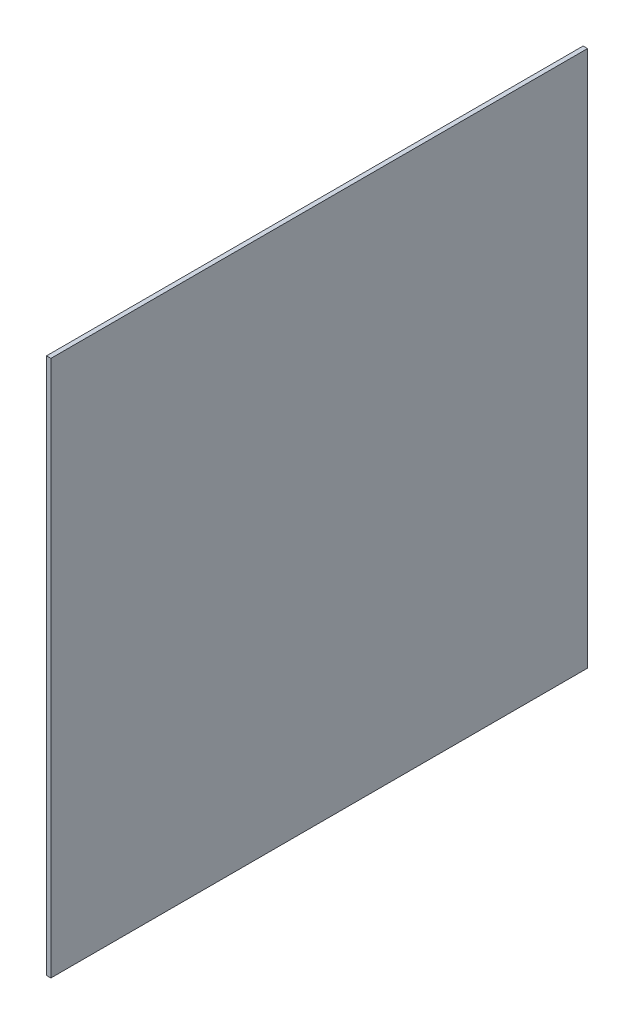
ISO-10303-21;
HEADER;
FILE_DESCRIPTION(('STEP AP214'),'2;1');
FILE_NAME('part.step','',(''),(''),'','','');
FILE_SCHEMA(('AUTOMOTIVE_DESIGN { 1 0 10303 214 1 1 1 1 }'));
ENDSEC;
DATA;
#1=APPLICATION_CONTEXT('core data for automotive mechanical design processes');
#2=APPLICATION_PROTOCOL_DEFINITION('international standard','automotive_design',2000,#1);
#3=PRODUCT_CONTEXT('',#1,'mechanical');
#4=PRODUCT('Part','Part','',(#3));
#5=PRODUCT_RELATED_PRODUCT_CATEGORY('part','',(#4));
#6=PRODUCT_DEFINITION_FORMATION('','',#4);
#7=PRODUCT_DEFINITION_CONTEXT('part definition',#1,'design');
#8=PRODUCT_DEFINITION('design','',#6,#7);
#9=PRODUCT_DEFINITION_SHAPE('','',#8);
#10=(LENGTH_UNIT() NAMED_UNIT(*) SI_UNIT(.MILLI.,.METRE.));
#11=(NAMED_UNIT(*) PLANE_ANGLE_UNIT() SI_UNIT($,.RADIAN.));
#12=(NAMED_UNIT(*) SI_UNIT($,.STERADIAN.) SOLID_ANGLE_UNIT());
#13=UNCERTAINTY_MEASURE_WITH_UNIT(LENGTH_MEASURE(1.E-05),#10,'distance_accuracy_value','');
#14=(GEOMETRIC_REPRESENTATION_CONTEXT(3) GLOBAL_UNCERTAINTY_ASSIGNED_CONTEXT((#13)) GLOBAL_UNIT_ASSIGNED_CONTEXT((#10,
#11,#12)) REPRESENTATION_CONTEXT('',''));
#15=CARTESIAN_POINT('',(0.,0.,0.));
#16=DIRECTION('',(0.,0.,1.));
#17=DIRECTION('',(1.,0.,0.));
#18=AXIS2_PLACEMENT_3D('',#15,#16,#17);
#19=CARTESIAN_POINT('',(4.7625,-289.71875,-289.71875));
#20=DIRECTION('',(0.,0.,1.));
#21=DIRECTION('',(1.,0.,0.));
#22=AXIS2_PLACEMENT_3D('',#19,#20,#21);
#23=PLANE('',#22);
#24=DIRECTION('',(0.,1.,0.));
#25=VECTOR('',#24,1.);
#26=CARTESIAN_POINT('',(0.,-289.71875,-289.71875));
#27=LINE('',#26,#25);
#28=CARTESIAN_POINT('',(0.,-289.71875,-289.71875));
#29=VERTEX_POINT('',#28);
#30=CARTESIAN_POINT('',(0.,289.71875,-289.71875));
#31=VERTEX_POINT('',#30);
#32=EDGE_CURVE('E96',#29,#31,#27,.T.);
#33=ORIENTED_EDGE('',*,*,#32,.T.);
#34=DIRECTION('',(-1.,0.,0.));
#35=VECTOR('',#34,1.);
#36=CARTESIAN_POINT('',(4.7625,289.71875,-289.71875));
#37=LINE('',#36,#35);
#38=CARTESIAN_POINT('',(4.7625,289.71875,-289.71875));
#39=VERTEX_POINT('',#38);
#40=EDGE_CURVE('E11',#39,#31,#37,.T.);
#41=ORIENTED_EDGE('',*,*,#40,.F.);
#42=DIRECTION('',(0.,1.,0.));
#43=VECTOR('',#42,1.);
#44=CARTESIAN_POINT('',(4.7625,-289.71875,-289.71875));
#45=LINE('',#44,#43);
#46=CARTESIAN_POINT('',(4.7625,-289.71875,-289.71875));
#47=VERTEX_POINT('',#46);
#48=EDGE_CURVE('E84',#47,#39,#45,.T.);
#49=ORIENTED_EDGE('',*,*,#48,.F.);
#50=DIRECTION('',(-1.,0.,0.));
#51=VECTOR('',#50,1.);
#52=CARTESIAN_POINT('',(4.7625,-289.71875,-289.71875));
#53=LINE('',#52,#51);
#54=EDGE_CURVE('E92',#47,#29,#53,.T.);
#55=ORIENTED_EDGE('',*,*,#54,.T.);
#56=EDGE_LOOP('',(#33,#41,#49,#55));
#57=FACE_BOUND('',#56,.T.);
#58=ADVANCED_FACE('F33',(#57),#23,.F.);
#59=CARTESIAN_POINT('',(4.7625,289.71875,289.71875));
#60=DIRECTION('',(0.,-1.,0.));
#61=DIRECTION('',(0.,0.,-1.));
#62=AXIS2_PLACEMENT_3D('',#59,#60,#61);
#63=PLANE('',#62);
#64=DIRECTION('',(0.,0.,1.));
#65=VECTOR('',#64,1.);
#66=CARTESIAN_POINT('',(0.,289.71875,289.71875));
#67=LINE('',#66,#65);
#68=CARTESIAN_POINT('',(0.,289.71875,289.71875));
#69=VERTEX_POINT('',#68);
#70=EDGE_CURVE('E88',#31,#69,#67,.T.);
#71=ORIENTED_EDGE('',*,*,#70,.T.);
#72=DIRECTION('',(-1.,0.,0.));
#73=VECTOR('',#72,1.);
#74=CARTESIAN_POINT('',(4.7625,289.71875,289.71875));
#75=LINE('',#74,#73);
#76=CARTESIAN_POINT('',(4.7625,289.71875,289.71875));
#77=VERTEX_POINT('',#76);
#78=EDGE_CURVE('E41',#77,#69,#75,.T.);
#79=ORIENTED_EDGE('',*,*,#78,.F.);
#80=DIRECTION('',(0.,0.,1.));
#81=VECTOR('',#80,1.);
#82=CARTESIAN_POINT('',(4.7625,289.71875,289.71875));
#83=LINE('',#82,#81);
#84=EDGE_CURVE('E79',#39,#77,#83,.T.);
#85=ORIENTED_EDGE('',*,*,#84,.F.);
#86=ORIENTED_EDGE('',*,*,#40,.T.);
#87=EDGE_LOOP('',(#71,#79,#85,#86));
#88=FACE_BOUND('',#87,.T.);
#89=ADVANCED_FACE('F87',(#88),#63,.F.);
#90=CARTESIAN_POINT('',(4.7625,-289.71875,289.71875));
#91=DIRECTION('',(0.,0.,-1.));
#92=DIRECTION('',(-1.,0.,0.));
#93=AXIS2_PLACEMENT_3D('',#90,#91,#92);
#94=PLANE('',#93);
#95=DIRECTION('',(0.,-1.,0.));
#96=VECTOR('',#95,1.);
#97=CARTESIAN_POINT('',(0.,-289.71875,289.71875));
#98=LINE('',#97,#96);
#99=CARTESIAN_POINT('',(0.,-289.71875,289.71875));
#100=VERTEX_POINT('',#99);
#101=EDGE_CURVE('E66',#69,#100,#98,.T.);
#102=ORIENTED_EDGE('',*,*,#101,.T.);
#103=DIRECTION('',(-1.,0.,0.));
#104=VECTOR('',#103,1.);
#105=CARTESIAN_POINT('',(4.7625,-289.71875,289.71875));
#106=LINE('',#105,#104);
#107=CARTESIAN_POINT('',(4.7625,-289.71875,289.71875));
#108=VERTEX_POINT('',#107);
#109=EDGE_CURVE('E89',#108,#100,#106,.T.);
#110=ORIENTED_EDGE('',*,*,#109,.F.);
#111=DIRECTION('',(0.,-1.,0.));
#112=VECTOR('',#111,1.);
#113=CARTESIAN_POINT('',(4.7625,-289.71875,289.71875));
#114=LINE('',#113,#112);
#115=EDGE_CURVE('E82',#77,#108,#114,.T.);
#116=ORIENTED_EDGE('',*,*,#115,.F.);
#117=ORIENTED_EDGE('',*,*,#78,.T.);
#118=EDGE_LOOP('',(#102,#110,#116,#117));
#119=FACE_BOUND('',#118,.T.);
#120=ADVANCED_FACE('F90',(#119),#94,.F.);
#121=CARTESIAN_POINT('',(4.7625,-289.71875,289.71875));
#122=DIRECTION('',(0.,1.,0.));
#123=DIRECTION('',(0.,0.,1.));
#124=AXIS2_PLACEMENT_3D('',#121,#122,#123);
#125=PLANE('',#124);
#126=DIRECTION('',(0.,0.,-1.));
#127=VECTOR('',#126,1.);
#128=CARTESIAN_POINT('',(0.,-289.71875,289.71875));
#129=LINE('',#128,#127);
#130=EDGE_CURVE('E72',#100,#29,#129,.T.);
#131=ORIENTED_EDGE('',*,*,#130,.T.);
#132=ORIENTED_EDGE('',*,*,#54,.F.);
#133=DIRECTION('',(0.,0.,-1.));
#134=VECTOR('',#133,1.);
#135=CARTESIAN_POINT('',(4.7625,-289.71875,289.71875));
#136=LINE('',#135,#134);
#137=EDGE_CURVE('E49',#108,#47,#136,.T.);
#138=ORIENTED_EDGE('',*,*,#137,.F.);
#139=ORIENTED_EDGE('',*,*,#109,.T.);
#140=EDGE_LOOP('',(#131,#132,#138,#139));
#141=FACE_BOUND('',#140,.T.);
#142=ADVANCED_FACE('F103',(#141),#125,.F.);
#143=CARTESIAN_POINT('',(4.7625,0.,0.));
#144=DIRECTION('',(-1.,0.,0.));
#145=DIRECTION('',(0.,0.,1.));
#146=AXIS2_PLACEMENT_3D('',#143,#144,#145);
#147=PLANE('',#146);
#148=ORIENTED_EDGE('',*,*,#48,.T.);
#149=ORIENTED_EDGE('',*,*,#84,.T.);
#150=ORIENTED_EDGE('',*,*,#115,.T.);
#151=ORIENTED_EDGE('',*,*,#137,.T.);
#152=EDGE_LOOP('',(#148,#149,#150,#151));
#153=FACE_BOUND('',#152,.T.);
#154=ADVANCED_FACE('F80',(#153),#147,.F.);
#155=CARTESIAN_POINT('',(0.,0.,0.));
#156=DIRECTION('',(-1.,0.,0.));
#157=DIRECTION('',(0.,0.,1.));
#158=AXIS2_PLACEMENT_3D('',#155,#156,#157);
#159=PLANE('',#158);
#160=ORIENTED_EDGE('',*,*,#32,.F.);
#161=ORIENTED_EDGE('',*,*,#130,.F.);
#162=ORIENTED_EDGE('',*,*,#101,.F.);
#163=ORIENTED_EDGE('',*,*,#70,.F.);
#164=EDGE_LOOP('',(#160,#161,#162,#163));
#165=FACE_BOUND('',#164,.T.);
#166=ADVANCED_FACE('F106',(#165),#159,.T.);
#167=CLOSED_SHELL('',(#58,#89,#120,#142,#154,#166));
#168=MANIFOLD_SOLID_BREP('B2',#167);
#169=ADVANCED_BREP_SHAPE_REPRESENTATION('',(#18,#168),#14);
#170=SHAPE_DEFINITION_REPRESENTATION(#9,#169);
ENDSEC;
END-ISO-10303-21;
